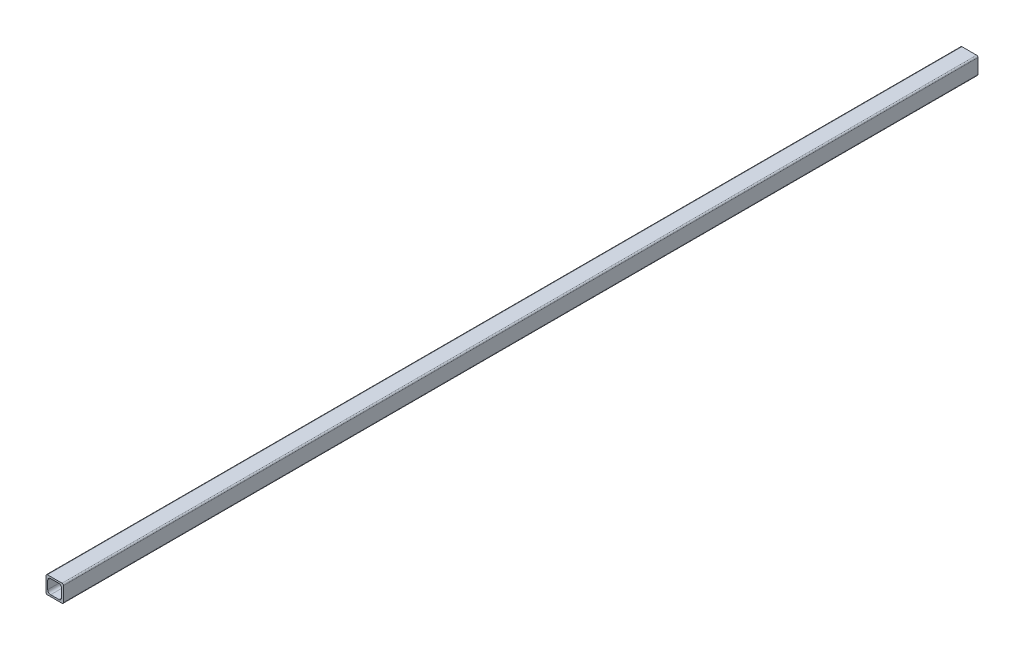
ISO-10303-21;
HEADER;
FILE_DESCRIPTION(('STEP AP214'),'2;1');
FILE_NAME('part.step','',(''),(''),'','','');
FILE_SCHEMA(('AUTOMOTIVE_DESIGN { 1 0 10303 214 1 1 1 1 }'));
ENDSEC;
DATA;
#1=APPLICATION_CONTEXT('core data for automotive mechanical design processes');
#2=APPLICATION_PROTOCOL_DEFINITION('international standard','automotive_design',2000,#1);
#3=PRODUCT_CONTEXT('',#1,'mechanical');
#4=PRODUCT('Part','Part','',(#3));
#5=PRODUCT_RELATED_PRODUCT_CATEGORY('part','',(#4));
#6=PRODUCT_DEFINITION_FORMATION('','',#4);
#7=PRODUCT_DEFINITION_CONTEXT('part definition',#1,'design');
#8=PRODUCT_DEFINITION('design','',#6,#7);
#9=PRODUCT_DEFINITION_SHAPE('','',#8);
#10=(LENGTH_UNIT() NAMED_UNIT(*) SI_UNIT(.MILLI.,.METRE.));
#11=(NAMED_UNIT(*) PLANE_ANGLE_UNIT() SI_UNIT($,.RADIAN.));
#12=(NAMED_UNIT(*) SI_UNIT($,.STERADIAN.) SOLID_ANGLE_UNIT());
#13=UNCERTAINTY_MEASURE_WITH_UNIT(LENGTH_MEASURE(1.E-05),#10,'distance_accuracy_value','');
#14=(GEOMETRIC_REPRESENTATION_CONTEXT(3) GLOBAL_UNCERTAINTY_ASSIGNED_CONTEXT((#13)) GLOBAL_UNIT_ASSIGNED_CONTEXT((#10,
#11,#12)) REPRESENTATION_CONTEXT('',''));
#15=CARTESIAN_POINT('',(0.,0.,0.));
#16=DIRECTION('',(0.,0.,1.));
#17=DIRECTION('',(1.,0.,0.));
#18=AXIS2_PLACEMENT_3D('',#15,#16,#17);
#19=CARTESIAN_POINT('',(1.524,1.524,-1000.125));
#20=DIRECTION('',(0.,0.,1.));
#21=DIRECTION('',(1.,0.,0.));
#22=AXIS2_PLACEMENT_3D('',#19,#20,#21);
#23=CYLINDRICAL_SURFACE('',#22,1.524);
#24=CARTESIAN_POINT('',(1.524,1.524,0.));
#25=DIRECTION('',(0.,0.,1.));
#26=DIRECTION('',(1.,0.,0.));
#27=AXIS2_PLACEMENT_3D('',#24,#25,#26);
#28=CIRCLE('',#27,1.524);
#29=CARTESIAN_POINT('',(0.,1.52400000000001,0.));
#30=VERTEX_POINT('',#29);
#31=CARTESIAN_POINT('',(1.52400000000001,0.,0.));
#32=VERTEX_POINT('',#31);
#33=EDGE_CURVE('E209',#30,#32,#28,.T.);
#34=ORIENTED_EDGE('',*,*,#33,.F.);
#35=DIRECTION('',(0.,0.,1.));
#36=VECTOR('',#35,1.);
#37=CARTESIAN_POINT('',(0.,1.52400000000001,-1000.125));
#38=LINE('',#37,#36);
#39=CARTESIAN_POINT('',(0.,1.52400000000001,-1000.125));
#40=VERTEX_POINT('',#39);
#41=EDGE_CURVE('E11',#40,#30,#38,.T.);
#42=ORIENTED_EDGE('',*,*,#41,.F.);
#43=CARTESIAN_POINT('',(1.524,1.524,-1000.125));
#44=DIRECTION('',(0.,0.,1.));
#45=DIRECTION('',(1.,0.,0.));
#46=AXIS2_PLACEMENT_3D('',#43,#44,#45);
#47=CIRCLE('',#46,1.524);
#48=CARTESIAN_POINT('',(1.52400000000001,0.,-1000.125));
#49=VERTEX_POINT('',#48);
#50=EDGE_CURVE('E221',#40,#49,#47,.T.);
#51=ORIENTED_EDGE('',*,*,#50,.T.);
#52=DIRECTION('',(0.,0.,1.));
#53=VECTOR('',#52,1.);
#54=CARTESIAN_POINT('',(1.52400000000001,0.,-1000.125));
#55=LINE('',#54,#53);
#56=EDGE_CURVE('E42',#49,#32,#55,.T.);
#57=ORIENTED_EDGE('',*,*,#56,.T.);
#58=EDGE_LOOP('',(#34,#42,#51,#57));
#59=FACE_BOUND('',#58,.T.);
#60=ADVANCED_FACE('F39',(#59),#23,.T.);
#61=CARTESIAN_POINT('',(0.,1.52400000000001,-1000.125));
#62=DIRECTION('',(-1.,0.,0.));
#63=DIRECTION('',(0.,0.,1.));
#64=AXIS2_PLACEMENT_3D('',#61,#62,#63);
#65=PLANE('',#64);
#66=DIRECTION('',(0.,-1.,0.));
#67=VECTOR('',#66,1.);
#68=CARTESIAN_POINT('',(0.,1.52400000000001,0.));
#69=LINE('',#68,#67);
#70=CARTESIAN_POINT('',(0.,17.526,0.));
#71=VERTEX_POINT('',#70);
#72=EDGE_CURVE('E225',#71,#30,#69,.T.);
#73=ORIENTED_EDGE('',*,*,#72,.F.);
#74=DIRECTION('',(0.,0.,1.));
#75=VECTOR('',#74,1.);
#76=CARTESIAN_POINT('',(0.,17.526,-1000.125));
#77=LINE('',#76,#75);
#78=CARTESIAN_POINT('',(0.,17.526,-1000.125));
#79=VERTEX_POINT('',#78);
#80=EDGE_CURVE('E47',#79,#71,#77,.T.);
#81=ORIENTED_EDGE('',*,*,#80,.F.);
#82=DIRECTION('',(0.,-1.,0.));
#83=VECTOR('',#82,1.);
#84=CARTESIAN_POINT('',(0.,1.52400000000001,-1000.125));
#85=LINE('',#84,#83);
#86=EDGE_CURVE('E243',#79,#40,#85,.T.);
#87=ORIENTED_EDGE('',*,*,#86,.T.);
#88=ORIENTED_EDGE('',*,*,#41,.T.);
#89=EDGE_LOOP('',(#73,#81,#87,#88));
#90=FACE_BOUND('',#89,.T.);
#91=ADVANCED_FACE('F290',(#90),#65,.T.);
#92=CARTESIAN_POINT('',(1.524,17.526,-1000.125));
#93=DIRECTION('',(0.,0.,1.));
#94=DIRECTION('',(1.,0.,0.));
#95=AXIS2_PLACEMENT_3D('',#92,#93,#94);
#96=CYLINDRICAL_SURFACE('',#95,1.524);
#97=CARTESIAN_POINT('',(1.524,17.526,0.));
#98=DIRECTION('',(0.,0.,1.));
#99=DIRECTION('',(-1.,0.,0.));
#100=AXIS2_PLACEMENT_3D('',#97,#98,#99);
#101=CIRCLE('',#100,1.524);
#102=CARTESIAN_POINT('',(1.52400000000001,19.05,0.));
#103=VERTEX_POINT('',#102);
#104=EDGE_CURVE('E263',#103,#71,#101,.T.);
#105=ORIENTED_EDGE('',*,*,#104,.F.);
#106=DIRECTION('',(0.,0.,1.));
#107=VECTOR('',#106,1.);
#108=CARTESIAN_POINT('',(1.52400000000001,19.05,-1000.125));
#109=LINE('',#108,#107);
#110=CARTESIAN_POINT('',(1.52400000000001,19.05,-1000.125));
#111=VERTEX_POINT('',#110);
#112=EDGE_CURVE('E269',#111,#103,#109,.T.);
#113=ORIENTED_EDGE('',*,*,#112,.F.);
#114=CARTESIAN_POINT('',(1.524,17.526,-1000.125));
#115=DIRECTION('',(0.,0.,1.));
#116=DIRECTION('',(-1.,0.,0.));
#117=AXIS2_PLACEMENT_3D('',#114,#115,#116);
#118=CIRCLE('',#117,1.524);
#119=EDGE_CURVE('E240',#111,#79,#118,.T.);
#120=ORIENTED_EDGE('',*,*,#119,.T.);
#121=ORIENTED_EDGE('',*,*,#80,.T.);
#122=EDGE_LOOP('',(#105,#113,#120,#121));
#123=FACE_BOUND('',#122,.T.);
#124=ADVANCED_FACE('F309',(#123),#96,.T.);
#125=CARTESIAN_POINT('',(1.52400000000001,19.05,-1000.125));
#126=DIRECTION('',(0.,1.,0.));
#127=DIRECTION('',(0.,0.,1.));
#128=AXIS2_PLACEMENT_3D('',#125,#126,#127);
#129=PLANE('',#128);
#130=DIRECTION('',(-1.,0.,0.));
#131=VECTOR('',#130,1.);
#132=CARTESIAN_POINT('',(1.52400000000001,19.05,0.));
#133=LINE('',#132,#131);
#134=CARTESIAN_POINT('',(17.526,19.05,0.));
#135=VERTEX_POINT('',#134);
#136=EDGE_CURVE('E260',#135,#103,#133,.T.);
#137=ORIENTED_EDGE('',*,*,#136,.F.);
#138=DIRECTION('',(0.,0.,1.));
#139=VECTOR('',#138,1.);
#140=CARTESIAN_POINT('',(17.526,19.05,-1000.125));
#141=LINE('',#140,#139);
#142=CARTESIAN_POINT('',(17.526,19.05,-1000.125));
#143=VERTEX_POINT('',#142);
#144=EDGE_CURVE('E271',#143,#135,#141,.T.);
#145=ORIENTED_EDGE('',*,*,#144,.F.);
#146=DIRECTION('',(-1.,0.,0.));
#147=VECTOR('',#146,1.);
#148=CARTESIAN_POINT('',(1.52400000000001,19.05,-1000.125));
#149=LINE('',#148,#147);
#150=EDGE_CURVE('E237',#143,#111,#149,.T.);
#151=ORIENTED_EDGE('',*,*,#150,.T.);
#152=ORIENTED_EDGE('',*,*,#112,.T.);
#153=EDGE_LOOP('',(#137,#145,#151,#152));
#154=FACE_BOUND('',#153,.T.);
#155=ADVANCED_FACE('F307',(#154),#129,.T.);
#156=CARTESIAN_POINT('',(17.526,17.526,-1000.125));
#157=DIRECTION('',(0.,0.,1.));
#158=DIRECTION('',(1.,0.,0.));
#159=AXIS2_PLACEMENT_3D('',#156,#157,#158);
#160=CYLINDRICAL_SURFACE('',#159,1.524);
#161=CARTESIAN_POINT('',(17.526,17.526,0.));
#162=DIRECTION('',(0.,0.,1.));
#163=DIRECTION('',(1.,0.,0.));
#164=AXIS2_PLACEMENT_3D('',#161,#162,#163);
#165=CIRCLE('',#164,1.524);
#166=CARTESIAN_POINT('',(19.05,17.526,0.));
#167=VERTEX_POINT('',#166);
#168=EDGE_CURVE('E257',#167,#135,#165,.T.);
#169=ORIENTED_EDGE('',*,*,#168,.F.);
#170=DIRECTION('',(0.,0.,1.));
#171=VECTOR('',#170,1.);
#172=CARTESIAN_POINT('',(19.05,17.526,-1000.125));
#173=LINE('',#172,#171);
#174=CARTESIAN_POINT('',(19.05,17.526,-1000.125));
#175=VERTEX_POINT('',#174);
#176=EDGE_CURVE('E273',#175,#167,#173,.T.);
#177=ORIENTED_EDGE('',*,*,#176,.F.);
#178=CARTESIAN_POINT('',(17.526,17.526,-1000.125));
#179=DIRECTION('',(0.,0.,1.));
#180=DIRECTION('',(1.,0.,0.));
#181=AXIS2_PLACEMENT_3D('',#178,#179,#180);
#182=CIRCLE('',#181,1.524);
#183=EDGE_CURVE('E234',#175,#143,#182,.T.);
#184=ORIENTED_EDGE('',*,*,#183,.T.);
#185=ORIENTED_EDGE('',*,*,#144,.T.);
#186=EDGE_LOOP('',(#169,#177,#184,#185));
#187=FACE_BOUND('',#186,.T.);
#188=ADVANCED_FACE('F303',(#187),#160,.T.);
#189=CARTESIAN_POINT('',(19.05,1.52400000000001,-1000.125));
#190=DIRECTION('',(1.,0.,0.));
#191=DIRECTION('',(0.,0.,-1.));
#192=AXIS2_PLACEMENT_3D('',#189,#190,#191);
#193=PLANE('',#192);
#194=DIRECTION('',(0.,1.,0.));
#195=VECTOR('',#194,1.);
#196=CARTESIAN_POINT('',(19.05,1.52400000000001,0.));
#197=LINE('',#196,#195);
#198=CARTESIAN_POINT('',(19.05,1.52400000000001,0.));
#199=VERTEX_POINT('',#198);
#200=EDGE_CURVE('E254',#199,#167,#197,.T.);
#201=ORIENTED_EDGE('',*,*,#200,.F.);
#202=DIRECTION('',(0.,0.,1.));
#203=VECTOR('',#202,1.);
#204=CARTESIAN_POINT('',(19.05,1.52400000000001,-1000.125));
#205=LINE('',#204,#203);
#206=CARTESIAN_POINT('',(19.05,1.52400000000001,-1000.125));
#207=VERTEX_POINT('',#206);
#208=EDGE_CURVE('E275',#207,#199,#205,.T.);
#209=ORIENTED_EDGE('',*,*,#208,.F.);
#210=DIRECTION('',(0.,1.,0.));
#211=VECTOR('',#210,1.);
#212=CARTESIAN_POINT('',(19.05,1.52400000000001,-1000.125));
#213=LINE('',#212,#211);
#214=EDGE_CURVE('E231',#207,#175,#213,.T.);
#215=ORIENTED_EDGE('',*,*,#214,.T.);
#216=ORIENTED_EDGE('',*,*,#176,.T.);
#217=EDGE_LOOP('',(#201,#209,#215,#216));
#218=FACE_BOUND('',#217,.T.);
#219=ADVANCED_FACE('F301',(#218),#193,.T.);
#220=CARTESIAN_POINT('',(17.526,1.524,-1000.125));
#221=DIRECTION('',(0.,0.,1.));
#222=DIRECTION('',(1.,0.,0.));
#223=AXIS2_PLACEMENT_3D('',#220,#221,#222);
#224=CYLINDRICAL_SURFACE('',#223,1.524);
#225=CARTESIAN_POINT('',(17.526,1.524,0.));
#226=DIRECTION('',(0.,0.,1.));
#227=DIRECTION('',(1.,0.,0.));
#228=AXIS2_PLACEMENT_3D('',#225,#226,#227);
#229=CIRCLE('',#228,1.524);
#230=CARTESIAN_POINT('',(17.526,0.,0.));
#231=VERTEX_POINT('',#230);
#232=EDGE_CURVE('E251',#231,#199,#229,.T.);
#233=ORIENTED_EDGE('',*,*,#232,.F.);
#234=DIRECTION('',(0.,0.,1.));
#235=VECTOR('',#234,1.);
#236=CARTESIAN_POINT('',(17.526,0.,-1000.125));
#237=LINE('',#236,#235);
#238=CARTESIAN_POINT('',(17.526,0.,-1000.125));
#239=VERTEX_POINT('',#238);
#240=EDGE_CURVE('E276',#239,#231,#237,.T.);
#241=ORIENTED_EDGE('',*,*,#240,.F.);
#242=CARTESIAN_POINT('',(17.526,1.524,-1000.125));
#243=DIRECTION('',(0.,0.,1.));
#244=DIRECTION('',(1.,0.,0.));
#245=AXIS2_PLACEMENT_3D('',#242,#243,#244);
#246=CIRCLE('',#245,1.524);
#247=EDGE_CURVE('E228',#239,#207,#246,.T.);
#248=ORIENTED_EDGE('',*,*,#247,.T.);
#249=ORIENTED_EDGE('',*,*,#208,.T.);
#250=EDGE_LOOP('',(#233,#241,#248,#249));
#251=FACE_BOUND('',#250,.T.);
#252=ADVANCED_FACE('F297',(#251),#224,.T.);
#253=CARTESIAN_POINT('',(1.52400000000001,0.,-1000.125));
#254=DIRECTION('',(0.,-1.,0.));
#255=DIRECTION('',(0.,0.,-1.));
#256=AXIS2_PLACEMENT_3D('',#253,#254,#255);
#257=PLANE('',#256);
#258=DIRECTION('',(1.,0.,0.));
#259=VECTOR('',#258,1.);
#260=CARTESIAN_POINT('',(1.52400000000001,0.,0.));
#261=LINE('',#260,#259);
#262=EDGE_CURVE('E248',#32,#231,#261,.T.);
#263=ORIENTED_EDGE('',*,*,#262,.F.);
#264=ORIENTED_EDGE('',*,*,#56,.F.);
#265=DIRECTION('',(1.,0.,0.));
#266=VECTOR('',#265,1.);
#267=CARTESIAN_POINT('',(1.52400000000001,0.,-1000.125));
#268=LINE('',#267,#266);
#269=EDGE_CURVE('E224',#49,#239,#268,.T.);
#270=ORIENTED_EDGE('',*,*,#269,.T.);
#271=ORIENTED_EDGE('',*,*,#240,.T.);
#272=EDGE_LOOP('',(#263,#264,#270,#271));
#273=FACE_BOUND('',#272,.T.);
#274=ADVANCED_FACE('F284',(#273),#257,.T.);
#275=CARTESIAN_POINT('',(1.524,1.524,-1000.125));
#276=DIRECTION('',(0.,0.,1.));
#277=DIRECTION('',(1.,0.,0.));
#278=AXIS2_PLACEMENT_3D('',#275,#276,#277);
#279=PLANE('',#278);
#280=DIRECTION('',(0.,1.,0.));
#281=VECTOR('',#280,1.);
#282=CARTESIAN_POINT('',(17.145,13.97,-1000.125));
#283=LINE('',#282,#281);
#284=CARTESIAN_POINT('',(17.145,5.08000000000002,-1000.125));
#285=VERTEX_POINT('',#284);
#286=CARTESIAN_POINT('',(17.145,13.97,-1000.125));
#287=VERTEX_POINT('',#286);
#288=EDGE_CURVE('E160',#285,#287,#283,.T.);
#289=ORIENTED_EDGE('',*,*,#288,.T.);
#290=CARTESIAN_POINT('',(13.97,13.97,-1000.125));
#291=DIRECTION('',(0.,0.,1.));
#292=DIRECTION('',(-1.,0.,0.));
#293=AXIS2_PLACEMENT_3D('',#290,#291,#292);
#294=CIRCLE('',#293,3.175);
#295=CARTESIAN_POINT('',(13.97,17.145,-1000.125));
#296=VERTEX_POINT('',#295);
#297=EDGE_CURVE('E154',#287,#296,#294,.T.);
#298=ORIENTED_EDGE('',*,*,#297,.T.);
#299=DIRECTION('',(-1.,0.,0.));
#300=VECTOR('',#299,1.);
#301=CARTESIAN_POINT('',(5.08000000000003,17.145,-1000.125));
#302=LINE('',#301,#300);
#303=CARTESIAN_POINT('',(5.08000000000003,17.145,-1000.125));
#304=VERTEX_POINT('',#303);
#305=EDGE_CURVE('E163',#296,#304,#302,.T.);
#306=ORIENTED_EDGE('',*,*,#305,.T.);
#307=CARTESIAN_POINT('',(5.08000000000001,13.97,-1000.125));
#308=DIRECTION('',(0.,0.,1.));
#309=DIRECTION('',(-1.,0.,0.));
#310=AXIS2_PLACEMENT_3D('',#307,#308,#309);
#311=CIRCLE('',#310,3.175);
#312=CARTESIAN_POINT('',(1.90500000000001,13.97,-1000.125));
#313=VERTEX_POINT('',#312);
#314=EDGE_CURVE('E55',#304,#313,#311,.T.);
#315=ORIENTED_EDGE('',*,*,#314,.T.);
#316=DIRECTION('',(0.,-1.,0.));
#317=VECTOR('',#316,1.);
#318=CARTESIAN_POINT('',(1.90500000000001,13.97,-1000.125));
#319=LINE('',#318,#317);
#320=CARTESIAN_POINT('',(1.90500000000001,5.08000000000002,-1000.125));
#321=VERTEX_POINT('',#320);
#322=EDGE_CURVE('E178',#313,#321,#319,.T.);
#323=ORIENTED_EDGE('',*,*,#322,.T.);
#324=CARTESIAN_POINT('',(5.08000000000001,5.08,-1000.125));
#325=DIRECTION('',(0.,0.,1.));
#326=DIRECTION('',(-1.,0.,0.));
#327=AXIS2_PLACEMENT_3D('',#324,#325,#326);
#328=CIRCLE('',#327,3.175);
#329=CARTESIAN_POINT('',(5.08000000000003,1.905,-1000.125));
#330=VERTEX_POINT('',#329);
#331=EDGE_CURVE('E181',#321,#330,#328,.T.);
#332=ORIENTED_EDGE('',*,*,#331,.T.);
#333=DIRECTION('',(1.,0.,0.));
#334=VECTOR('',#333,1.);
#335=CARTESIAN_POINT('',(5.08000000000003,1.905,-1000.125));
#336=LINE('',#335,#334);
#337=CARTESIAN_POINT('',(13.97,1.905,-1000.125));
#338=VERTEX_POINT('',#337);
#339=EDGE_CURVE('E184',#330,#338,#336,.T.);
#340=ORIENTED_EDGE('',*,*,#339,.T.);
#341=CARTESIAN_POINT('',(13.97,5.08,-1000.125));
#342=DIRECTION('',(0.,0.,1.));
#343=DIRECTION('',(-1.,0.,0.));
#344=AXIS2_PLACEMENT_3D('',#341,#342,#343);
#345=CIRCLE('',#344,3.175);
#346=EDGE_CURVE('E187',#338,#285,#345,.T.);
#347=ORIENTED_EDGE('',*,*,#346,.T.);
#348=EDGE_LOOP('',(#289,#298,#306,#315,#323,#332,#340,#347));
#349=FACE_BOUND('',#348,.T.);
#350=ORIENTED_EDGE('',*,*,#50,.F.);
#351=ORIENTED_EDGE('',*,*,#86,.F.);
#352=ORIENTED_EDGE('',*,*,#119,.F.);
#353=ORIENTED_EDGE('',*,*,#150,.F.);
#354=ORIENTED_EDGE('',*,*,#183,.F.);
#355=ORIENTED_EDGE('',*,*,#214,.F.);
#356=ORIENTED_EDGE('',*,*,#247,.F.);
#357=ORIENTED_EDGE('',*,*,#269,.F.);
#358=EDGE_LOOP('',(#350,#351,#352,#353,#354,#355,#356,#357));
#359=FACE_BOUND('',#358,.T.);
#360=ADVANCED_FACE('F167',(#349,#359),#279,.F.);
#361=CARTESIAN_POINT('',(1.524,1.524,0.));
#362=DIRECTION('',(0.,0.,1.));
#363=DIRECTION('',(1.,0.,0.));
#364=AXIS2_PLACEMENT_3D('',#361,#362,#363);
#365=PLANE('',#364);
#366=CARTESIAN_POINT('',(13.97,13.97,0.));
#367=DIRECTION('',(0.,0.,1.));
#368=DIRECTION('',(-1.,0.,0.));
#369=AXIS2_PLACEMENT_3D('',#366,#367,#368);
#370=CIRCLE('',#369,3.175);
#371=CARTESIAN_POINT('',(17.145,13.97,0.));
#372=VERTEX_POINT('',#371);
#373=CARTESIAN_POINT('',(13.97,17.145,0.));
#374=VERTEX_POINT('',#373);
#375=EDGE_CURVE('E63',#372,#374,#370,.T.);
#376=ORIENTED_EDGE('',*,*,#375,.F.);
#377=DIRECTION('',(0.,1.,0.));
#378=VECTOR('',#377,1.);
#379=CARTESIAN_POINT('',(17.145,13.97,0.));
#380=LINE('',#379,#378);
#381=CARTESIAN_POINT('',(17.145,5.08000000000002,0.));
#382=VERTEX_POINT('',#381);
#383=EDGE_CURVE('E171',#382,#372,#380,.T.);
#384=ORIENTED_EDGE('',*,*,#383,.F.);
#385=CARTESIAN_POINT('',(13.97,5.08,0.));
#386=DIRECTION('',(0.,0.,1.));
#387=DIRECTION('',(-1.,0.,0.));
#388=AXIS2_PLACEMENT_3D('',#385,#386,#387);
#389=CIRCLE('',#388,3.175);
#390=CARTESIAN_POINT('',(13.97,1.905,0.));
#391=VERTEX_POINT('',#390);
#392=EDGE_CURVE('E174',#391,#382,#389,.T.);
#393=ORIENTED_EDGE('',*,*,#392,.F.);
#394=DIRECTION('',(1.,0.,0.));
#395=VECTOR('',#394,1.);
#396=CARTESIAN_POINT('',(5.08000000000003,1.905,0.));
#397=LINE('',#396,#395);
#398=CARTESIAN_POINT('',(5.08000000000003,1.905,0.));
#399=VERTEX_POINT('',#398);
#400=EDGE_CURVE('E202',#399,#391,#397,.T.);
#401=ORIENTED_EDGE('',*,*,#400,.F.);
#402=CARTESIAN_POINT('',(5.08000000000001,5.08,0.));
#403=DIRECTION('',(0.,0.,1.));
#404=DIRECTION('',(-1.,0.,0.));
#405=AXIS2_PLACEMENT_3D('',#402,#403,#404);
#406=CIRCLE('',#405,3.175);
#407=CARTESIAN_POINT('',(1.90500000000001,5.08000000000002,0.));
#408=VERTEX_POINT('',#407);
#409=EDGE_CURVE('E199',#408,#399,#406,.T.);
#410=ORIENTED_EDGE('',*,*,#409,.F.);
#411=DIRECTION('',(0.,-1.,0.));
#412=VECTOR('',#411,1.);
#413=CARTESIAN_POINT('',(1.90500000000001,13.97,0.));
#414=LINE('',#413,#412);
#415=CARTESIAN_POINT('',(1.90500000000001,13.97,0.));
#416=VERTEX_POINT('',#415);
#417=EDGE_CURVE('E196',#416,#408,#414,.T.);
#418=ORIENTED_EDGE('',*,*,#417,.F.);
#419=CARTESIAN_POINT('',(5.08000000000001,13.97,0.));
#420=DIRECTION('',(0.,0.,1.));
#421=DIRECTION('',(-1.,0.,0.));
#422=AXIS2_PLACEMENT_3D('',#419,#420,#421);
#423=CIRCLE('',#422,3.175);
#424=CARTESIAN_POINT('',(5.08000000000003,17.145,0.));
#425=VERTEX_POINT('',#424);
#426=EDGE_CURVE('E193',#425,#416,#423,.T.);
#427=ORIENTED_EDGE('',*,*,#426,.F.);
#428=DIRECTION('',(-1.,0.,0.));
#429=VECTOR('',#428,1.);
#430=CARTESIAN_POINT('',(5.08000000000003,17.145,0.));
#431=LINE('',#430,#429);
#432=EDGE_CURVE('E191',#374,#425,#431,.T.);
#433=ORIENTED_EDGE('',*,*,#432,.F.);
#434=EDGE_LOOP('',(#376,#384,#393,#401,#410,#418,#427,#433));
#435=FACE_BOUND('',#434,.T.);
#436=ORIENTED_EDGE('',*,*,#33,.T.);
#437=ORIENTED_EDGE('',*,*,#262,.T.);
#438=ORIENTED_EDGE('',*,*,#232,.T.);
#439=ORIENTED_EDGE('',*,*,#200,.T.);
#440=ORIENTED_EDGE('',*,*,#168,.T.);
#441=ORIENTED_EDGE('',*,*,#136,.T.);
#442=ORIENTED_EDGE('',*,*,#104,.T.);
#443=ORIENTED_EDGE('',*,*,#72,.T.);
#444=EDGE_LOOP('',(#436,#437,#438,#439,#440,#441,#442,#443));
#445=FACE_BOUND('',#444,.T.);
#446=ADVANCED_FACE('F286',(#435,#445),#365,.T.);
#447=CARTESIAN_POINT('',(13.97,13.97,-1000.125));
#448=DIRECTION('',(0.,0.,1.));
#449=DIRECTION('',(1.,0.,0.));
#450=AXIS2_PLACEMENT_3D('',#447,#448,#449);
#451=CYLINDRICAL_SURFACE('',#450,3.175);
#452=ORIENTED_EDGE('',*,*,#375,.T.);
#453=DIRECTION('',(0.,0.,1.));
#454=VECTOR('',#453,1.);
#455=CARTESIAN_POINT('',(13.97,17.145,-1000.125));
#456=LINE('',#455,#454);
#457=EDGE_CURVE('E150',#296,#374,#456,.T.);
#458=ORIENTED_EDGE('',*,*,#457,.F.);
#459=ORIENTED_EDGE('',*,*,#297,.F.);
#460=DIRECTION('',(0.,0.,1.));
#461=VECTOR('',#460,1.);
#462=CARTESIAN_POINT('',(17.145,13.97,-1000.125));
#463=LINE('',#462,#461);
#464=EDGE_CURVE('E207',#287,#372,#463,.T.);
#465=ORIENTED_EDGE('',*,*,#464,.T.);
#466=EDGE_LOOP('',(#452,#458,#459,#465));
#467=FACE_BOUND('',#466,.T.);
#468=ADVANCED_FACE('F152',(#467),#451,.F.);
#469=CARTESIAN_POINT('',(17.145,13.97,-1000.125));
#470=DIRECTION('',(1.,0.,0.));
#471=DIRECTION('',(0.,1.,0.));
#472=AXIS2_PLACEMENT_3D('',#469,#470,#471);
#473=PLANE('',#472);
#474=ORIENTED_EDGE('',*,*,#383,.T.);
#475=ORIENTED_EDGE('',*,*,#464,.F.);
#476=ORIENTED_EDGE('',*,*,#288,.F.);
#477=DIRECTION('',(0.,0.,1.));
#478=VECTOR('',#477,1.);
#479=CARTESIAN_POINT('',(17.145,5.08000000000002,-1000.125));
#480=LINE('',#479,#478);
#481=EDGE_CURVE('E210',#285,#382,#480,.T.);
#482=ORIENTED_EDGE('',*,*,#481,.T.);
#483=EDGE_LOOP('',(#474,#475,#476,#482));
#484=FACE_BOUND('',#483,.T.);
#485=ADVANCED_FACE('F394',(#484),#473,.F.);
#486=CARTESIAN_POINT('',(13.97,5.08,-1000.125));
#487=DIRECTION('',(0.,0.,1.));
#488=DIRECTION('',(1.,0.,0.));
#489=AXIS2_PLACEMENT_3D('',#486,#487,#488);
#490=CYLINDRICAL_SURFACE('',#489,3.175);
#491=ORIENTED_EDGE('',*,*,#392,.T.);
#492=ORIENTED_EDGE('',*,*,#481,.F.);
#493=ORIENTED_EDGE('',*,*,#346,.F.);
#494=DIRECTION('',(0.,0.,1.));
#495=VECTOR('',#494,1.);
#496=CARTESIAN_POINT('',(13.97,1.905,-1000.125));
#497=LINE('',#496,#495);
#498=EDGE_CURVE('E212',#338,#391,#497,.T.);
#499=ORIENTED_EDGE('',*,*,#498,.T.);
#500=EDGE_LOOP('',(#491,#492,#493,#499));
#501=FACE_BOUND('',#500,.T.);
#502=ADVANCED_FACE('F403',(#501),#490,.F.);
#503=CARTESIAN_POINT('',(5.08000000000003,1.905,-1000.125));
#504=DIRECTION('',(0.,-1.,0.));
#505=DIRECTION('',(0.,0.,-1.));
#506=AXIS2_PLACEMENT_3D('',#503,#504,#505);
#507=PLANE('',#506);
#508=ORIENTED_EDGE('',*,*,#400,.T.);
#509=ORIENTED_EDGE('',*,*,#498,.F.);
#510=ORIENTED_EDGE('',*,*,#339,.F.);
#511=DIRECTION('',(0.,0.,1.));
#512=VECTOR('',#511,1.);
#513=CARTESIAN_POINT('',(5.08000000000003,1.905,-1000.125));
#514=LINE('',#513,#512);
#515=EDGE_CURVE('E214',#330,#399,#514,.T.);
#516=ORIENTED_EDGE('',*,*,#515,.T.);
#517=EDGE_LOOP('',(#508,#509,#510,#516));
#518=FACE_BOUND('',#517,.T.);
#519=ADVANCED_FACE('F413',(#518),#507,.F.);
#520=CARTESIAN_POINT('',(5.08000000000001,5.08,-1000.125));
#521=DIRECTION('',(0.,0.,1.));
#522=DIRECTION('',(1.,0.,0.));
#523=AXIS2_PLACEMENT_3D('',#520,#521,#522);
#524=CYLINDRICAL_SURFACE('',#523,3.175);
#525=ORIENTED_EDGE('',*,*,#409,.T.);
#526=ORIENTED_EDGE('',*,*,#515,.F.);
#527=ORIENTED_EDGE('',*,*,#331,.F.);
#528=DIRECTION('',(0.,0.,1.));
#529=VECTOR('',#528,1.);
#530=CARTESIAN_POINT('',(1.90500000000001,5.08000000000002,-1000.125));
#531=LINE('',#530,#529);
#532=EDGE_CURVE('E216',#321,#408,#531,.T.);
#533=ORIENTED_EDGE('',*,*,#532,.T.);
#534=EDGE_LOOP('',(#525,#526,#527,#533));
#535=FACE_BOUND('',#534,.T.);
#536=ADVANCED_FACE('F423',(#535),#524,.F.);
#537=CARTESIAN_POINT('',(1.90500000000001,13.97,-1000.125));
#538=DIRECTION('',(-1.,0.,0.));
#539=DIRECTION('',(0.,-1.,0.));
#540=AXIS2_PLACEMENT_3D('',#537,#538,#539);
#541=PLANE('',#540);
#542=ORIENTED_EDGE('',*,*,#417,.T.);
#543=ORIENTED_EDGE('',*,*,#532,.F.);
#544=ORIENTED_EDGE('',*,*,#322,.F.);
#545=DIRECTION('',(0.,0.,1.));
#546=VECTOR('',#545,1.);
#547=CARTESIAN_POINT('',(1.90500000000001,13.97,-1000.125));
#548=LINE('',#547,#546);
#549=EDGE_CURVE('E218',#313,#416,#548,.T.);
#550=ORIENTED_EDGE('',*,*,#549,.T.);
#551=EDGE_LOOP('',(#542,#543,#544,#550));
#552=FACE_BOUND('',#551,.T.);
#553=ADVANCED_FACE('F433',(#552),#541,.F.);
#554=CARTESIAN_POINT('',(5.08000000000001,13.97,-1000.125));
#555=DIRECTION('',(0.,0.,1.));
#556=DIRECTION('',(1.,0.,0.));
#557=AXIS2_PLACEMENT_3D('',#554,#555,#556);
#558=CYLINDRICAL_SURFACE('',#557,3.175);
#559=ORIENTED_EDGE('',*,*,#426,.T.);
#560=ORIENTED_EDGE('',*,*,#549,.F.);
#561=ORIENTED_EDGE('',*,*,#314,.F.);
#562=DIRECTION('',(0.,0.,1.));
#563=VECTOR('',#562,1.);
#564=CARTESIAN_POINT('',(5.08000000000003,17.145,-1000.125));
#565=LINE('',#564,#563);
#566=EDGE_CURVE('E159',#304,#425,#565,.T.);
#567=ORIENTED_EDGE('',*,*,#566,.T.);
#568=EDGE_LOOP('',(#559,#560,#561,#567));
#569=FACE_BOUND('',#568,.T.);
#570=ADVANCED_FACE('F443',(#569),#558,.F.);
#571=CARTESIAN_POINT('',(5.08000000000003,17.145,-1000.125));
#572=DIRECTION('',(0.,1.,0.));
#573=DIRECTION('',(0.,0.,1.));
#574=AXIS2_PLACEMENT_3D('',#571,#572,#573);
#575=PLANE('',#574);
#576=ORIENTED_EDGE('',*,*,#432,.T.);
#577=ORIENTED_EDGE('',*,*,#566,.F.);
#578=ORIENTED_EDGE('',*,*,#305,.F.);
#579=ORIENTED_EDGE('',*,*,#457,.T.);
#580=EDGE_LOOP('',(#576,#577,#578,#579));
#581=FACE_BOUND('',#580,.T.);
#582=ADVANCED_FACE('F164',(#581),#575,.F.);
#583=CLOSED_SHELL('',(#60,#91,#124,#155,#188,#219,#252,#274,#360,#446,#468,#485,#502,#519,#536,
#553,#570,#582));
#584=MANIFOLD_SOLID_BREP('B2',#583);
#585=ADVANCED_BREP_SHAPE_REPRESENTATION('',(#18,#584),#14);
#586=SHAPE_DEFINITION_REPRESENTATION(#9,#585);
ENDSEC;
END-ISO-10303-21;
